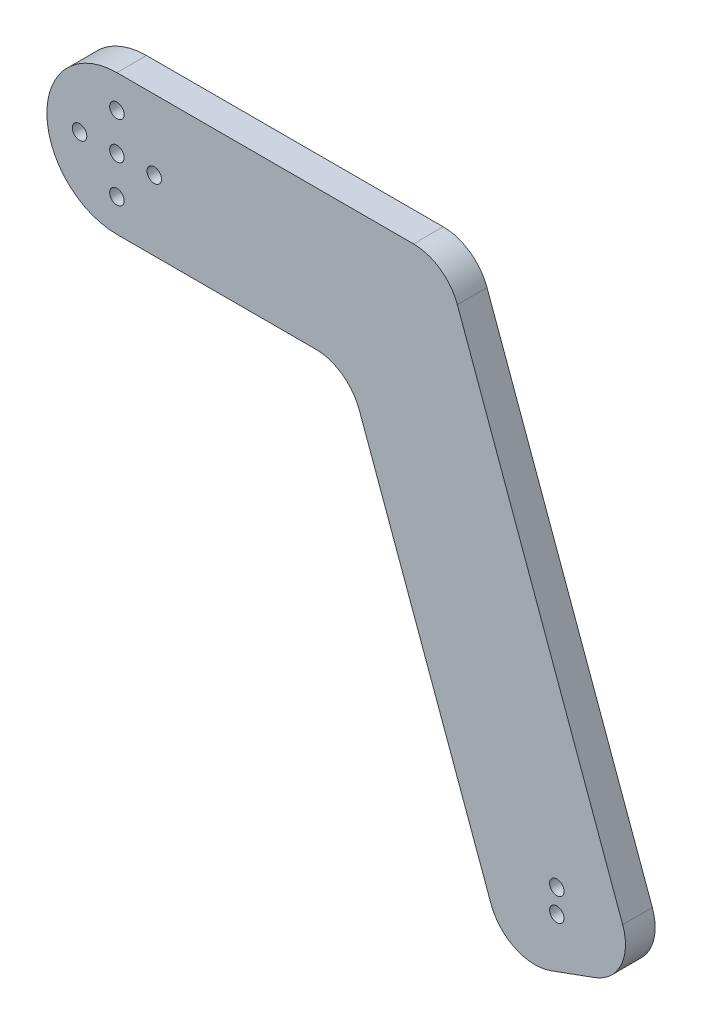
ISO-10303-21;
HEADER;
FILE_DESCRIPTION(('STEP AP214'),'2;1');
FILE_NAME('part.step','',(''),(''),'','','');
FILE_SCHEMA(('AUTOMOTIVE_DESIGN { 1 0 10303 214 1 1 1 1 }'));
ENDSEC;
DATA;
#1=APPLICATION_CONTEXT('core data for automotive mechanical design processes');
#2=APPLICATION_PROTOCOL_DEFINITION('international standard','automotive_design',2000,#1);
#3=PRODUCT_CONTEXT('',#1,'mechanical');
#4=PRODUCT('Part','Part','',(#3));
#5=PRODUCT_RELATED_PRODUCT_CATEGORY('part','',(#4));
#6=PRODUCT_DEFINITION_FORMATION('','',#4);
#7=PRODUCT_DEFINITION_CONTEXT('part definition',#1,'design');
#8=PRODUCT_DEFINITION('design','',#6,#7);
#9=PRODUCT_DEFINITION_SHAPE('','',#8);
#10=(LENGTH_UNIT() NAMED_UNIT(*) SI_UNIT(.MILLI.,.METRE.));
#11=(NAMED_UNIT(*) PLANE_ANGLE_UNIT() SI_UNIT($,.RADIAN.));
#12=(NAMED_UNIT(*) SI_UNIT($,.STERADIAN.) SOLID_ANGLE_UNIT());
#13=UNCERTAINTY_MEASURE_WITH_UNIT(LENGTH_MEASURE(1.E-05),#10,'distance_accuracy_value','');
#14=(GEOMETRIC_REPRESENTATION_CONTEXT(3) GLOBAL_UNCERTAINTY_ASSIGNED_CONTEXT((#13)) GLOBAL_UNIT_ASSIGNED_CONTEXT((#10,
#11,#12)) REPRESENTATION_CONTEXT('',''));
#15=CARTESIAN_POINT('',(0.,0.,0.));
#16=DIRECTION('',(0.,0.,1.));
#17=DIRECTION('',(1.,0.,0.));
#18=AXIS2_PLACEMENT_3D('',#15,#16,#17);
#19=CARTESIAN_POINT('',(38.8859439817808,14.1533261407111,6.35));
#20=DIRECTION('',(0.939692620785909,0.342020143325666,0.));
#21=DIRECTION('',(-0.342020143325666,0.939692620785909,0.));
#22=AXIS2_PLACEMENT_3D('',#19,#20,#21);
#23=PLANE('',#22);
#24=DIRECTION('',(0.342020143325666,-0.939692620785909,0.));
#25=VECTOR('',#24,1.);
#26=CARTESIAN_POINT('',(38.8859439817808,14.1533261407111,0.));
#27=LINE('',#26,#25);
#28=CARTESIAN_POINT('',(51.8917377526163,-21.5797985667433,0.));
#29=VERTEX_POINT('',#28);
#30=CARTESIAN_POINT('',(80.106625020778,-99.099564228476,0.));
#31=VERTEX_POINT('',#30);
#32=EDGE_CURVE('E182',#29,#31,#27,.T.);
#33=ORIENTED_EDGE('',*,*,#32,.T.);
#34=DIRECTION('',(0.,0.,-1.));
#35=VECTOR('',#34,1.);
#36=CARTESIAN_POINT('',(80.106625020778,-99.0995642284759,6.35));
#37=LINE('',#36,#35);
#38=CARTESIAN_POINT('',(80.106625020778,-99.099564228476,6.35));
#39=VERTEX_POINT('',#38);
#40=EDGE_CURVE('E66',#31,#39,#37,.F.);
#41=ORIENTED_EDGE('',*,*,#40,.T.);
#42=DIRECTION('',(0.342020143325666,-0.939692620785909,0.));
#43=VECTOR('',#42,1.);
#44=CARTESIAN_POINT('',(38.8859439817808,14.1533261407111,6.35));
#45=LINE('',#44,#43);
#46=CARTESIAN_POINT('',(51.8917377526163,-21.5797985667433,6.35));
#47=VERTEX_POINT('',#46);
#48=EDGE_CURVE('E222',#47,#39,#45,.T.);
#49=ORIENTED_EDGE('',*,*,#48,.F.);
#50=DIRECTION('',(0.,0.,-1.));
#51=VECTOR('',#50,1.);
#52=CARTESIAN_POINT('',(51.8917377526163,-21.5797985667433,0.));
#53=LINE('',#52,#51);
#54=EDGE_CURVE('E136',#47,#29,#53,.T.);
#55=ORIENTED_EDGE('',*,*,#54,.T.);
#56=EDGE_LOOP('',(#33,#41,#49,#55));
#57=FACE_BOUND('',#56,.T.);
#58=ADVANCED_FACE('F40',(#57),#23,.F.);
#59=CARTESIAN_POINT('',(44.6408824722539,-122.649816577046,6.35));
#60=DIRECTION('',(0.342020143325666,-0.939692620785909,0.));
#61=DIRECTION('',(0.939692620785909,0.342020143325666,0.));
#62=AXIS2_PLACEMENT_3D('',#59,#60,#61);
#63=PLANE('',#62);
#64=DIRECTION('',(-0.939692620785909,-0.342020143325666,0.));
#65=VECTOR('',#64,1.);
#66=CARTESIAN_POINT('',(44.6408824722539,-122.649816577046,6.35));
#67=LINE('',#66,#65);
#68=CARTESIAN_POINT('',(102.320678869753,-101.656087569822,6.35));
#69=VERTEX_POINT('',#68);
#70=CARTESIAN_POINT('',(92.9237526618938,-105.076289003078,6.35));
#71=VERTEX_POINT('',#70);
#72=EDGE_CURVE('E156',#69,#71,#67,.T.);
#73=ORIENTED_EDGE('',*,*,#72,.T.);
#74=DIRECTION('',(0.,0.,-1.));
#75=VECTOR('',#74,1.);
#76=CARTESIAN_POINT('',(92.9237526618938,-105.076289003078,0.));
#77=LINE('',#76,#75);
#78=CARTESIAN_POINT('',(92.9237526618938,-105.076289003078,0.));
#79=VERTEX_POINT('',#78);
#80=EDGE_CURVE('E251',#71,#79,#77,.T.);
#81=ORIENTED_EDGE('',*,*,#80,.T.);
#82=DIRECTION('',(-0.939692620785909,-0.342020143325666,0.));
#83=VECTOR('',#82,1.);
#84=CARTESIAN_POINT('',(44.6408824722539,-122.649816577046,0.));
#85=LINE('',#84,#83);
#86=CARTESIAN_POINT('',(102.320678869753,-101.656087569822,0.));
#87=VERTEX_POINT('',#86);
#88=EDGE_CURVE('E185',#87,#79,#85,.T.);
#89=ORIENTED_EDGE('',*,*,#88,.F.);
#90=DIRECTION('',(0.,0.,-1.));
#91=VECTOR('',#90,1.);
#92=CARTESIAN_POINT('',(102.320678869753,-101.656087569822,6.35));
#93=LINE('',#92,#91);
#94=EDGE_CURVE('E248',#87,#69,#93,.F.);
#95=ORIENTED_EDGE('',*,*,#94,.T.);
#96=EDGE_LOOP('',(#73,#81,#89,#95));
#97=FACE_BOUND('',#96,.T.);
#98=ADVANCED_FACE('F289',(#97),#63,.T.);
#99=CARTESIAN_POINT('',(67.0767226053581,24.4139304404811,6.35));
#100=DIRECTION('',(0.939692620785909,0.342020143325666,0.));
#101=DIRECTION('',(-0.342020143325666,0.939692620785909,0.));
#102=AXIS2_PLACEMENT_3D('',#99,#100,#101);
#103=PLANE('',#102);
#104=DIRECTION('',(0.342020143325666,-0.939692620785909,0.));
#105=VECTOR('',#104,1.);
#106=CARTESIAN_POINT('',(67.0767226053581,24.4139304404811,6.35));
#107=LINE('',#106,#105);
#108=CARTESIAN_POINT('',(72.8979638989076,8.42020143325666,6.35));
#109=VERTEX_POINT('',#108);
#110=CARTESIAN_POINT('',(108.297403644355,-88.838959928706,6.35));
#111=VERTEX_POINT('',#110);
#112=EDGE_CURVE('E153',#109,#111,#107,.T.);
#113=ORIENTED_EDGE('',*,*,#112,.T.);
#114=DIRECTION('',(0.,0.,-1.));
#115=VECTOR('',#114,1.);
#116=CARTESIAN_POINT('',(108.297403644355,-88.838959928706,6.35));
#117=LINE('',#116,#115);
#118=CARTESIAN_POINT('',(108.297403644355,-88.838959928706,0.));
#119=VERTEX_POINT('',#118);
#120=EDGE_CURVE('E11',#111,#119,#117,.T.);
#121=ORIENTED_EDGE('',*,*,#120,.T.);
#122=DIRECTION('',(0.342020143325666,-0.939692620785909,0.));
#123=VECTOR('',#122,1.);
#124=CARTESIAN_POINT('',(67.0767226053581,24.4139304404811,0.));
#125=LINE('',#124,#123);
#126=CARTESIAN_POINT('',(72.8979638989076,8.42020143325666,0.));
#127=VERTEX_POINT('',#126);
#128=EDGE_CURVE('E189',#127,#119,#125,.T.);
#129=ORIENTED_EDGE('',*,*,#128,.F.);
#130=DIRECTION('',(0.,0.,-1.));
#131=VECTOR('',#130,1.);
#132=CARTESIAN_POINT('',(72.8979638989076,8.42020143325666,6.35));
#133=LINE('',#132,#131);
#134=EDGE_CURVE('E237',#127,#109,#133,.F.);
#135=ORIENTED_EDGE('',*,*,#134,.T.);
#136=EDGE_LOOP('',(#113,#121,#129,#135));
#137=FACE_BOUND('',#136,.T.);
#138=ADVANCED_FACE('F326',(#137),#103,.T.);
#139=CARTESIAN_POINT('',(0.,15.,6.35));
#140=DIRECTION('',(0.,1.,0.));
#141=DIRECTION('',(0.,0.,1.));
#142=AXIS2_PLACEMENT_3D('',#139,#140,#141);
#143=PLANE('',#142);
#144=DIRECTION('',(1.,0.,0.));
#145=VECTOR('',#144,1.);
#146=CARTESIAN_POINT('',(0.,15.,6.35));
#147=LINE('',#146,#145);
#148=CARTESIAN_POINT('',(0.,15.,6.35));
#149=VERTEX_POINT('',#148);
#150=CARTESIAN_POINT('',(63.5010376910486,15.,6.35));
#151=VERTEX_POINT('',#150);
#152=EDGE_CURVE('E129',#149,#151,#147,.T.);
#153=ORIENTED_EDGE('',*,*,#152,.T.);
#154=DIRECTION('',(0.,0.,-1.));
#155=VECTOR('',#154,1.);
#156=CARTESIAN_POINT('',(63.5010376910486,15.,6.35));
#157=LINE('',#156,#155);
#158=CARTESIAN_POINT('',(63.5010376910486,15.,0.));
#159=VERTEX_POINT('',#158);
#160=EDGE_CURVE('E231',#151,#159,#157,.T.);
#161=ORIENTED_EDGE('',*,*,#160,.T.);
#162=DIRECTION('',(1.,0.,0.));
#163=VECTOR('',#162,1.);
#164=CARTESIAN_POINT('',(0.,15.,0.));
#165=LINE('',#164,#163);
#166=CARTESIAN_POINT('',(0.,15.,0.));
#167=VERTEX_POINT('',#166);
#168=EDGE_CURVE('E132',#167,#159,#165,.T.);
#169=ORIENTED_EDGE('',*,*,#168,.F.);
#170=DIRECTION('',(0.,0.,-1.));
#171=VECTOR('',#170,1.);
#172=CARTESIAN_POINT('',(0.,15.,6.35));
#173=LINE('',#172,#171);
#174=EDGE_CURVE('E124',#149,#167,#173,.T.);
#175=ORIENTED_EDGE('',*,*,#174,.F.);
#176=EDGE_LOOP('',(#153,#161,#169,#175));
#177=FACE_BOUND('',#176,.T.);
#178=ADVANCED_FACE('F126',(#177),#143,.T.);
#179=CARTESIAN_POINT('',(0.,0.,6.35));
#180=DIRECTION('',(0.,0.,-1.));
#181=DIRECTION('',(-1.,0.,0.));
#182=AXIS2_PLACEMENT_3D('',#179,#180,#181);
#183=CYLINDRICAL_SURFACE('',#182,15.);
#184=CARTESIAN_POINT('',(0.,0.,0.));
#185=DIRECTION('',(0.,0.,1.));
#186=DIRECTION('',(1.,0.,0.));
#187=AXIS2_PLACEMENT_3D('',#184,#185,#186);
#188=CIRCLE('',#187,15.);
#189=CARTESIAN_POINT('',(0.,-15.,0.));
#190=VERTEX_POINT('',#189);
#191=EDGE_CURVE('E195',#167,#190,#188,.T.);
#192=ORIENTED_EDGE('',*,*,#191,.T.);
#193=DIRECTION('',(0.,0.,-1.));
#194=VECTOR('',#193,1.);
#195=CARTESIAN_POINT('',(0.,-15.,6.35));
#196=LINE('',#195,#194);
#197=CARTESIAN_POINT('',(0.,-15.,6.35));
#198=VERTEX_POINT('',#197);
#199=EDGE_CURVE('E137',#198,#190,#196,.T.);
#200=ORIENTED_EDGE('',*,*,#199,.F.);
#201=CARTESIAN_POINT('',(0.,0.,6.35));
#202=DIRECTION('',(0.,0.,1.));
#203=DIRECTION('',(1.,0.,0.));
#204=AXIS2_PLACEMENT_3D('',#201,#202,#203);
#205=CIRCLE('',#204,15.);
#206=EDGE_CURVE('E140',#149,#198,#205,.T.);
#207=ORIENTED_EDGE('',*,*,#206,.F.);
#208=ORIENTED_EDGE('',*,*,#174,.T.);
#209=EDGE_LOOP('',(#192,#200,#207,#208));
#210=FACE_BOUND('',#209,.T.);
#211=ADVANCED_FACE('F141',(#210),#183,.T.);
#212=CARTESIAN_POINT('',(-8.,0.,6.35));
#213=DIRECTION('',(0.,0.,-1.));
#214=DIRECTION('',(-1.,0.,0.));
#215=AXIS2_PLACEMENT_3D('',#212,#213,#214);
#216=CYLINDRICAL_SURFACE('',#215,1.55);
#217=CARTESIAN_POINT('',(-8.,0.,6.35));
#218=DIRECTION('',(0.,0.,1.));
#219=DIRECTION('',(1.,0.,0.));
#220=AXIS2_PLACEMENT_3D('',#217,#218,#219);
#221=CIRCLE('',#220,1.55);
#222=CARTESIAN_POINT('',(-6.45,0.,6.35));
#223=VERTEX_POINT('',#222);
#224=EDGE_CURVE('E174',#223,#223,#221,.T.);
#225=ORIENTED_EDGE('',*,*,#224,.T.);
#226=EDGE_LOOP('',(#225));
#227=FACE_BOUND('',#226,.T.);
#228=CARTESIAN_POINT('',(-8.,0.,0.));
#229=DIRECTION('',(0.,0.,1.));
#230=DIRECTION('',(1.,0.,0.));
#231=AXIS2_PLACEMENT_3D('',#228,#229,#230);
#232=CIRCLE('',#231,1.55);
#233=CARTESIAN_POINT('',(-6.45,0.,0.));
#234=VERTEX_POINT('',#233);
#235=EDGE_CURVE('E214',#234,#234,#232,.T.);
#236=ORIENTED_EDGE('',*,*,#235,.F.);
#237=EDGE_LOOP('',(#236));
#238=FACE_BOUND('',#237,.T.);
#239=ADVANCED_FACE('F357',(#227,#238),#216,.F.);
#240=CARTESIAN_POINT('',(0.,8.,6.35));
#241=DIRECTION('',(0.,0.,-1.));
#242=DIRECTION('',(-1.,0.,0.));
#243=AXIS2_PLACEMENT_3D('',#240,#241,#242);
#244=CYLINDRICAL_SURFACE('',#243,1.55);
#245=CARTESIAN_POINT('',(0.,8.,6.35));
#246=DIRECTION('',(0.,0.,1.));
#247=DIRECTION('',(1.,0.,0.));
#248=AXIS2_PLACEMENT_3D('',#245,#246,#247);
#249=CIRCLE('',#248,1.55);
#250=CARTESIAN_POINT('',(1.55,8.,6.35));
#251=VERTEX_POINT('',#250);
#252=EDGE_CURVE('E170',#251,#251,#249,.T.);
#253=ORIENTED_EDGE('',*,*,#252,.T.);
#254=EDGE_LOOP('',(#253));
#255=FACE_BOUND('',#254,.T.);
#256=CARTESIAN_POINT('',(0.,8.,0.));
#257=DIRECTION('',(0.,0.,1.));
#258=DIRECTION('',(1.,0.,0.));
#259=AXIS2_PLACEMENT_3D('',#256,#257,#258);
#260=CIRCLE('',#259,1.55);
#261=CARTESIAN_POINT('',(1.55,8.,0.));
#262=VERTEX_POINT('',#261);
#263=EDGE_CURVE('E210',#262,#262,#260,.T.);
#264=ORIENTED_EDGE('',*,*,#263,.F.);
#265=EDGE_LOOP('',(#264));
#266=FACE_BOUND('',#265,.T.);
#267=ADVANCED_FACE('F361',(#255,#266),#244,.F.);
#268=CARTESIAN_POINT('',(0.,-8.,6.35));
#269=DIRECTION('',(0.,0.,-1.));
#270=DIRECTION('',(-1.,0.,0.));
#271=AXIS2_PLACEMENT_3D('',#268,#269,#270);
#272=CYLINDRICAL_SURFACE('',#271,1.55);
#273=CARTESIAN_POINT('',(0.,-8.,6.35));
#274=DIRECTION('',(0.,0.,1.));
#275=DIRECTION('',(1.,0.,0.));
#276=AXIS2_PLACEMENT_3D('',#273,#274,#275);
#277=CIRCLE('',#276,1.55);
#278=CARTESIAN_POINT('',(1.55,-8.,6.35));
#279=VERTEX_POINT('',#278);
#280=EDGE_CURVE('E166',#279,#279,#277,.T.);
#281=ORIENTED_EDGE('',*,*,#280,.T.);
#282=EDGE_LOOP('',(#281));
#283=FACE_BOUND('',#282,.T.);
#284=CARTESIAN_POINT('',(0.,-8.,0.));
#285=DIRECTION('',(0.,0.,1.));
#286=DIRECTION('',(1.,0.,0.));
#287=AXIS2_PLACEMENT_3D('',#284,#285,#286);
#288=CIRCLE('',#287,1.55);
#289=CARTESIAN_POINT('',(1.55,-8.,0.));
#290=VERTEX_POINT('',#289);
#291=EDGE_CURVE('E206',#290,#290,#288,.T.);
#292=ORIENTED_EDGE('',*,*,#291,.F.);
#293=EDGE_LOOP('',(#292));
#294=FACE_BOUND('',#293,.T.);
#295=ADVANCED_FACE('F317',(#283,#294),#272,.F.);
#296=CARTESIAN_POINT('',(8.,0.,6.35));
#297=DIRECTION('',(0.,0.,-1.));
#298=DIRECTION('',(-1.,0.,0.));
#299=AXIS2_PLACEMENT_3D('',#296,#297,#298);
#300=CYLINDRICAL_SURFACE('',#299,1.55);
#301=CARTESIAN_POINT('',(8.,0.,6.35));
#302=DIRECTION('',(0.,0.,1.));
#303=DIRECTION('',(1.,0.,0.));
#304=AXIS2_PLACEMENT_3D('',#301,#302,#303);
#305=CIRCLE('',#304,1.55);
#306=CARTESIAN_POINT('',(9.55,0.,6.35));
#307=VERTEX_POINT('',#306);
#308=EDGE_CURVE('E162',#307,#307,#305,.T.);
#309=ORIENTED_EDGE('',*,*,#308,.T.);
#310=EDGE_LOOP('',(#309));
#311=FACE_BOUND('',#310,.T.);
#312=CARTESIAN_POINT('',(8.,0.,0.));
#313=DIRECTION('',(0.,0.,1.));
#314=DIRECTION('',(1.,0.,0.));
#315=AXIS2_PLACEMENT_3D('',#312,#313,#314);
#316=CIRCLE('',#315,1.55);
#317=CARTESIAN_POINT('',(9.55,0.,0.));
#318=VERTEX_POINT('',#317);
#319=EDGE_CURVE('E202',#318,#318,#316,.T.);
#320=ORIENTED_EDGE('',*,*,#319,.F.);
#321=EDGE_LOOP('',(#320));
#322=FACE_BOUND('',#321,.T.);
#323=ADVANCED_FACE('F309',(#311,#322),#300,.F.);
#324=CARTESIAN_POINT('',(0.,-15.,6.35));
#325=DIRECTION('',(0.,1.,0.));
#326=DIRECTION('',(0.,0.,1.));
#327=AXIS2_PLACEMENT_3D('',#324,#325,#326);
#328=PLANE('',#327);
#329=DIRECTION('',(1.,0.,0.));
#330=VECTOR('',#329,1.);
#331=CARTESIAN_POINT('',(0.,-15.,0.));
#332=LINE('',#331,#330);
#333=CARTESIAN_POINT('',(42.4948115447572,-15.,0.));
#334=VERTEX_POINT('',#333);
#335=EDGE_CURVE('E198',#190,#334,#332,.T.);
#336=ORIENTED_EDGE('',*,*,#335,.T.);
#337=DIRECTION('',(0.,0.,-1.));
#338=VECTOR('',#337,1.);
#339=CARTESIAN_POINT('',(42.4948115447572,-15.,6.35));
#340=LINE('',#339,#338);
#341=CARTESIAN_POINT('',(42.4948115447572,-15.,6.35));
#342=VERTEX_POINT('',#341);
#343=EDGE_CURVE('E228',#334,#342,#340,.F.);
#344=ORIENTED_EDGE('',*,*,#343,.T.);
#345=DIRECTION('',(1.,0.,0.));
#346=VECTOR('',#345,1.);
#347=CARTESIAN_POINT('',(0.,-15.,6.35));
#348=LINE('',#347,#346);
#349=EDGE_CURVE('E146',#198,#342,#348,.T.);
#350=ORIENTED_EDGE('',*,*,#349,.F.);
#351=ORIENTED_EDGE('',*,*,#199,.T.);
#352=EDGE_LOOP('',(#336,#344,#350,#351));
#353=FACE_BOUND('',#352,.T.);
#354=ADVANCED_FACE('F306',(#353),#328,.F.);
#355=CARTESIAN_POINT('',(0.,0.,6.35));
#356=DIRECTION('',(0.,0.,-1.));
#357=DIRECTION('',(-1.,0.,0.));
#358=AXIS2_PLACEMENT_3D('',#355,#356,#357);
#359=CYLINDRICAL_SURFACE('',#358,1.55);
#360=CARTESIAN_POINT('',(0.,0.,6.35));
#361=DIRECTION('',(0.,0.,1.));
#362=DIRECTION('',(1.,0.,0.));
#363=AXIS2_PLACEMENT_3D('',#360,#361,#362);
#364=CIRCLE('',#363,1.55);
#365=CARTESIAN_POINT('',(1.55,0.,6.35));
#366=VERTEX_POINT('',#365);
#367=EDGE_CURVE('E178',#366,#366,#364,.T.);
#368=ORIENTED_EDGE('',*,*,#367,.T.);
#369=EDGE_LOOP('',(#368));
#370=FACE_BOUND('',#369,.T.);
#371=CARTESIAN_POINT('',(0.,0.,0.));
#372=DIRECTION('',(0.,0.,1.));
#373=DIRECTION('',(1.,0.,0.));
#374=AXIS2_PLACEMENT_3D('',#371,#372,#373);
#375=CIRCLE('',#374,1.55);
#376=CARTESIAN_POINT('',(1.55,0.,0.));
#377=VERTEX_POINT('',#376);
#378=EDGE_CURVE('E218',#377,#377,#375,.T.);
#379=ORIENTED_EDGE('',*,*,#378,.F.);
#380=EDGE_LOOP('',(#379));
#381=FACE_BOUND('',#380,.T.);
#382=ADVANCED_FACE('F308',(#370,#381),#359,.F.);
#383=CARTESIAN_POINT('',(0.,0.,6.35));
#384=DIRECTION('',(0.,0.,1.));
#385=DIRECTION('',(1.,0.,0.));
#386=AXIS2_PLACEMENT_3D('',#383,#384,#385);
#387=PLANE('',#386);
#388=CARTESIAN_POINT('',(94.2020143325667,-88.969262078591,6.35));
#389=DIRECTION('',(0.,0.,1.));
#390=DIRECTION('',(1.,0.,0.));
#391=AXIS2_PLACEMENT_3D('',#388,#389,#390);
#392=CIRCLE('',#391,1.54999999999999);
#393=CARTESIAN_POINT('',(95.7520143325666,-88.969262078591,6.35));
#394=VERTEX_POINT('',#393);
#395=EDGE_CURVE('E269',#394,#394,#392,.T.);
#396=ORIENTED_EDGE('',*,*,#395,.F.);
#397=EDGE_LOOP('',(#396));
#398=FACE_BOUND('',#397,.T.);
#399=CARTESIAN_POINT('',(94.2020143325667,-93.969262078591,6.35));
#400=DIRECTION('',(0.,0.,1.));
#401=DIRECTION('',(1.,0.,0.));
#402=AXIS2_PLACEMENT_3D('',#399,#400,#401);
#403=CIRCLE('',#402,1.54999999999999);
#404=CARTESIAN_POINT('',(95.7520143325666,-93.969262078591,6.35));
#405=VERTEX_POINT('',#404);
#406=EDGE_CURVE('E276',#405,#405,#403,.T.);
#407=ORIENTED_EDGE('',*,*,#406,.F.);
#408=EDGE_LOOP('',(#407));
#409=FACE_BOUND('',#408,.T.);
#410=ORIENTED_EDGE('',*,*,#48,.T.);
#411=CARTESIAN_POINT('',(89.5035512286371,-95.6793627952193,6.35));
#412=DIRECTION('',(0.,0.,1.));
#413=DIRECTION('',(1.,0.,0.));
#414=AXIS2_PLACEMENT_3D('',#411,#412,#413);
#415=CIRCLE('',#414,10.);
#416=EDGE_CURVE('E50',#39,#71,#415,.T.);
#417=ORIENTED_EDGE('',*,*,#416,.T.);
#418=ORIENTED_EDGE('',*,*,#72,.F.);
#419=CARTESIAN_POINT('',(98.9004774364962,-92.2591613619626,6.35));
#420=DIRECTION('',(0.,0.,1.));
#421=DIRECTION('',(1.,0.,0.));
#422=AXIS2_PLACEMENT_3D('',#419,#420,#421);
#423=CIRCLE('',#422,10.);
#424=EDGE_CURVE('E58',#69,#111,#423,.T.);
#425=ORIENTED_EDGE('',*,*,#424,.T.);
#426=ORIENTED_EDGE('',*,*,#112,.F.);
#427=CARTESIAN_POINT('',(63.5010376910486,5.,6.35));
#428=DIRECTION('',(0.,0.,1.));
#429=DIRECTION('',(1.,0.,0.));
#430=AXIS2_PLACEMENT_3D('',#427,#428,#429);
#431=CIRCLE('',#430,10.);
#432=EDGE_CURVE('E151',#109,#151,#431,.T.);
#433=ORIENTED_EDGE('',*,*,#432,.T.);
#434=ORIENTED_EDGE('',*,*,#152,.F.);
#435=ORIENTED_EDGE('',*,*,#206,.T.);
#436=ORIENTED_EDGE('',*,*,#349,.T.);
#437=CARTESIAN_POINT('',(42.4948115447572,-25.,6.35));
#438=DIRECTION('',(0.,0.,1.));
#439=DIRECTION('',(1.,0.,0.));
#440=AXIS2_PLACEMENT_3D('',#437,#438,#439);
#441=CIRCLE('',#440,10.);
#442=EDGE_CURVE('E245',#342,#47,#441,.F.);
#443=ORIENTED_EDGE('',*,*,#442,.T.);
#444=EDGE_LOOP('',(#410,#417,#418,#425,#426,#433,#434,#435,#436,#443));
#445=FACE_BOUND('',#444,.T.);
#446=ORIENTED_EDGE('',*,*,#308,.F.);
#447=EDGE_LOOP('',(#446));
#448=FACE_BOUND('',#447,.T.);
#449=ORIENTED_EDGE('',*,*,#280,.F.);
#450=EDGE_LOOP('',(#449));
#451=FACE_BOUND('',#450,.T.);
#452=ORIENTED_EDGE('',*,*,#252,.F.);
#453=EDGE_LOOP('',(#452));
#454=FACE_BOUND('',#453,.T.);
#455=ORIENTED_EDGE('',*,*,#224,.F.);
#456=EDGE_LOOP('',(#455));
#457=FACE_BOUND('',#456,.T.);
#458=ORIENTED_EDGE('',*,*,#367,.F.);
#459=EDGE_LOOP('',(#458));
#460=FACE_BOUND('',#459,.T.);
#461=ADVANCED_FACE('F148',(#398,#409,#445,#448,#451,#454,#457,#460),#387,.T.);
#462=CARTESIAN_POINT('',(0.,0.,0.));
#463=DIRECTION('',(0.,0.,1.));
#464=DIRECTION('',(1.,0.,0.));
#465=AXIS2_PLACEMENT_3D('',#462,#463,#464);
#466=PLANE('',#465);
#467=CARTESIAN_POINT('',(94.2020143325667,-88.969262078591,0.));
#468=DIRECTION('',(0.,0.,1.));
#469=DIRECTION('',(1.,0.,0.));
#470=AXIS2_PLACEMENT_3D('',#467,#468,#469);
#471=CIRCLE('',#470,1.54999999999999);
#472=CARTESIAN_POINT('',(95.7520143325666,-88.969262078591,0.));
#473=VERTEX_POINT('',#472);
#474=EDGE_CURVE('E44',#473,#473,#471,.T.);
#475=ORIENTED_EDGE('',*,*,#474,.T.);
#476=EDGE_LOOP('',(#475));
#477=FACE_BOUND('',#476,.T.);
#478=CARTESIAN_POINT('',(94.2020143325667,-93.969262078591,0.));
#479=DIRECTION('',(0.,0.,1.));
#480=DIRECTION('',(1.,0.,0.));
#481=AXIS2_PLACEMENT_3D('',#478,#479,#480);
#482=CIRCLE('',#481,1.54999999999999);
#483=CARTESIAN_POINT('',(95.7520143325666,-93.969262078591,0.));
#484=VERTEX_POINT('',#483);
#485=EDGE_CURVE('E266',#484,#484,#482,.T.);
#486=ORIENTED_EDGE('',*,*,#485,.T.);
#487=EDGE_LOOP('',(#486));
#488=FACE_BOUND('',#487,.T.);
#489=ORIENTED_EDGE('',*,*,#88,.T.);
#490=CARTESIAN_POINT('',(89.5035512286371,-95.6793627952193,0.));
#491=DIRECTION('',(0.,0.,1.));
#492=DIRECTION('',(1.,0.,0.));
#493=AXIS2_PLACEMENT_3D('',#490,#491,#492);
#494=CIRCLE('',#493,10.);
#495=EDGE_CURVE('E258',#79,#31,#494,.F.);
#496=ORIENTED_EDGE('',*,*,#495,.T.);
#497=ORIENTED_EDGE('',*,*,#32,.F.);
#498=CARTESIAN_POINT('',(42.4948115447572,-25.,0.));
#499=DIRECTION('',(0.,0.,1.));
#500=DIRECTION('',(1.,0.,0.));
#501=AXIS2_PLACEMENT_3D('',#498,#499,#500);
#502=CIRCLE('',#501,10.);
#503=EDGE_CURVE('E242',#29,#334,#502,.T.);
#504=ORIENTED_EDGE('',*,*,#503,.T.);
#505=ORIENTED_EDGE('',*,*,#335,.F.);
#506=ORIENTED_EDGE('',*,*,#191,.F.);
#507=ORIENTED_EDGE('',*,*,#168,.T.);
#508=CARTESIAN_POINT('',(63.5010376910486,5.,0.));
#509=DIRECTION('',(0.,0.,1.));
#510=DIRECTION('',(1.,0.,0.));
#511=AXIS2_PLACEMENT_3D('',#508,#509,#510);
#512=CIRCLE('',#511,10.);
#513=EDGE_CURVE('E234',#159,#127,#512,.F.);
#514=ORIENTED_EDGE('',*,*,#513,.T.);
#515=ORIENTED_EDGE('',*,*,#128,.T.);
#516=CARTESIAN_POINT('',(98.9004774364962,-92.2591613619626,0.));
#517=DIRECTION('',(0.,0.,1.));
#518=DIRECTION('',(1.,0.,0.));
#519=AXIS2_PLACEMENT_3D('',#516,#517,#518);
#520=CIRCLE('',#519,10.);
#521=EDGE_CURVE('E255',#119,#87,#520,.F.);
#522=ORIENTED_EDGE('',*,*,#521,.T.);
#523=EDGE_LOOP('',(#489,#496,#497,#504,#505,#506,#507,#514,#515,#522));
#524=FACE_BOUND('',#523,.T.);
#525=ORIENTED_EDGE('',*,*,#319,.T.);
#526=EDGE_LOOP('',(#525));
#527=FACE_BOUND('',#526,.T.);
#528=ORIENTED_EDGE('',*,*,#291,.T.);
#529=EDGE_LOOP('',(#528));
#530=FACE_BOUND('',#529,.T.);
#531=ORIENTED_EDGE('',*,*,#263,.T.);
#532=EDGE_LOOP('',(#531));
#533=FACE_BOUND('',#532,.T.);
#534=ORIENTED_EDGE('',*,*,#235,.T.);
#535=EDGE_LOOP('',(#534));
#536=FACE_BOUND('',#535,.T.);
#537=ORIENTED_EDGE('',*,*,#378,.T.);
#538=EDGE_LOOP('',(#537));
#539=FACE_BOUND('',#538,.T.);
#540=ADVANCED_FACE('F297',(#477,#488,#524,#527,#530,#533,#536,#539),#466,.F.);
#541=CARTESIAN_POINT('',(42.4948115447572,-25.,6.35));
#542=DIRECTION('',(0.,0.,1.));
#543=DIRECTION('',(1.,0.,0.));
#544=AXIS2_PLACEMENT_3D('',#541,#542,#543);
#545=CYLINDRICAL_SURFACE('',#544,10.);
#546=ORIENTED_EDGE('',*,*,#442,.F.);
#547=ORIENTED_EDGE('',*,*,#343,.F.);
#548=ORIENTED_EDGE('',*,*,#503,.F.);
#549=ORIENTED_EDGE('',*,*,#54,.F.);
#550=EDGE_LOOP('',(#546,#547,#548,#549));
#551=FACE_BOUND('',#550,.T.);
#552=ADVANCED_FACE('F302',(#551),#545,.F.);
#553=CARTESIAN_POINT('',(63.5010376910486,5.,6.35));
#554=DIRECTION('',(0.,0.,-1.));
#555=DIRECTION('',(-1.,0.,0.));
#556=AXIS2_PLACEMENT_3D('',#553,#554,#555);
#557=CYLINDRICAL_SURFACE('',#556,10.);
#558=ORIENTED_EDGE('',*,*,#432,.F.);
#559=ORIENTED_EDGE('',*,*,#134,.F.);
#560=ORIENTED_EDGE('',*,*,#513,.F.);
#561=ORIENTED_EDGE('',*,*,#160,.F.);
#562=EDGE_LOOP('',(#558,#559,#560,#561));
#563=FACE_BOUND('',#562,.T.);
#564=ADVANCED_FACE('F332',(#563),#557,.T.);
#565=CARTESIAN_POINT('',(89.5035512286371,-95.6793627952193,6.35));
#566=DIRECTION('',(0.,0.,1.));
#567=DIRECTION('',(1.,0.,0.));
#568=AXIS2_PLACEMENT_3D('',#565,#566,#567);
#569=CYLINDRICAL_SURFACE('',#568,10.);
#570=ORIENTED_EDGE('',*,*,#416,.F.);
#571=ORIENTED_EDGE('',*,*,#40,.F.);
#572=ORIENTED_EDGE('',*,*,#495,.F.);
#573=ORIENTED_EDGE('',*,*,#80,.F.);
#574=EDGE_LOOP('',(#570,#571,#572,#573));
#575=FACE_BOUND('',#574,.T.);
#576=ADVANCED_FACE('F294',(#575),#569,.T.);
#577=CARTESIAN_POINT('',(98.9004774364962,-92.2591613619626,6.35));
#578=DIRECTION('',(0.,0.,-1.));
#579=DIRECTION('',(-1.,0.,0.));
#580=AXIS2_PLACEMENT_3D('',#577,#578,#579);
#581=CYLINDRICAL_SURFACE('',#580,10.);
#582=ORIENTED_EDGE('',*,*,#424,.F.);
#583=ORIENTED_EDGE('',*,*,#94,.F.);
#584=ORIENTED_EDGE('',*,*,#521,.F.);
#585=ORIENTED_EDGE('',*,*,#120,.F.);
#586=EDGE_LOOP('',(#582,#583,#584,#585));
#587=FACE_BOUND('',#586,.T.);
#588=ADVANCED_FACE('F42',(#587),#581,.T.);
#589=CARTESIAN_POINT('',(94.2020143325667,-93.969262078591,-3.65));
#590=DIRECTION('',(0.,0.,1.));
#591=DIRECTION('',(1.,0.,0.));
#592=AXIS2_PLACEMENT_3D('',#589,#590,#591);
#593=CYLINDRICAL_SURFACE('',#592,1.54999999999999);
#594=ORIENTED_EDGE('',*,*,#406,.T.);
#595=EDGE_LOOP('',(#594));
#596=FACE_BOUND('',#595,.T.);
#597=ORIENTED_EDGE('',*,*,#485,.F.);
#598=EDGE_LOOP('',(#597));
#599=FACE_BOUND('',#598,.T.);
#600=ADVANCED_FACE('F339',(#596,#599),#593,.F.);
#601=CARTESIAN_POINT('',(94.2020143325667,-88.969262078591,-3.65));
#602=DIRECTION('',(0.,0.,1.));
#603=DIRECTION('',(1.,0.,0.));
#604=AXIS2_PLACEMENT_3D('',#601,#602,#603);
#605=CYLINDRICAL_SURFACE('',#604,1.54999999999999);
#606=ORIENTED_EDGE('',*,*,#395,.T.);
#607=EDGE_LOOP('',(#606));
#608=FACE_BOUND('',#607,.T.);
#609=ORIENTED_EDGE('',*,*,#474,.F.);
#610=EDGE_LOOP('',(#609));
#611=FACE_BOUND('',#610,.T.);
#612=ADVANCED_FACE('F344',(#608,#611),#605,.F.);
#613=CLOSED_SHELL('',(#58,#98,#138,#178,#211,#239,#267,#295,#323,#354,#382,#461,#540,#552,#564,
#576,#588,#600,#612));
#614=MANIFOLD_SOLID_BREP('B2',#613);
#615=ADVANCED_BREP_SHAPE_REPRESENTATION('',(#18,#614),#14);
#616=SHAPE_DEFINITION_REPRESENTATION(#9,#615);
ENDSEC;
END-ISO-10303-21;
